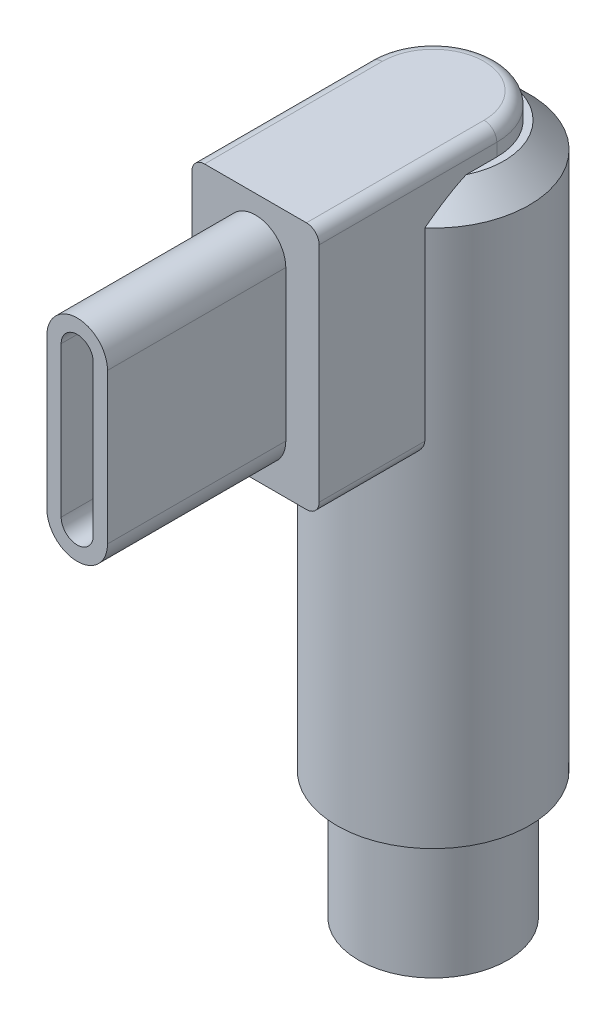
ISO-10303-21;
HEADER;
FILE_DESCRIPTION(('STEP AP214'),'2;1');
FILE_NAME('part.step','',(''),(''),'','','');
FILE_SCHEMA(('AUTOMOTIVE_DESIGN { 1 0 10303 214 1 1 1 1 }'));
ENDSEC;
DATA;
#1=APPLICATION_CONTEXT('core data for automotive mechanical design processes');
#2=APPLICATION_PROTOCOL_DEFINITION('international standard','automotive_design',2000,#1);
#3=PRODUCT_CONTEXT('',#1,'mechanical');
#4=PRODUCT('Part','Part','',(#3));
#5=PRODUCT_RELATED_PRODUCT_CATEGORY('part','',(#4));
#6=PRODUCT_DEFINITION_FORMATION('','',#4);
#7=PRODUCT_DEFINITION_CONTEXT('part definition',#1,'design');
#8=PRODUCT_DEFINITION('design','',#6,#7);
#9=PRODUCT_DEFINITION_SHAPE('','',#8);
#10=(LENGTH_UNIT() NAMED_UNIT(*) SI_UNIT(.MILLI.,.METRE.));
#11=(NAMED_UNIT(*) PLANE_ANGLE_UNIT() SI_UNIT($,.RADIAN.));
#12=(NAMED_UNIT(*) SI_UNIT($,.STERADIAN.) SOLID_ANGLE_UNIT());
#13=UNCERTAINTY_MEASURE_WITH_UNIT(LENGTH_MEASURE(1.E-05),#10,'distance_accuracy_value','');
#14=(GEOMETRIC_REPRESENTATION_CONTEXT(3) GLOBAL_UNCERTAINTY_ASSIGNED_CONTEXT((#13)) GLOBAL_UNIT_ASSIGNED_CONTEXT((#10,
#11,#12)) REPRESENTATION_CONTEXT('',''));
#15=CARTESIAN_POINT('',(0.,0.,0.));
#16=DIRECTION('',(0.,0.,1.));
#17=DIRECTION('',(1.,0.,0.));
#18=AXIS2_PLACEMENT_3D('',#15,#16,#17);
#19=CARTESIAN_POINT('',(0.,28.1,0.));
#20=DIRECTION('',(0.,-1.,0.));
#21=DIRECTION('',(0.,0.,-1.));
#22=AXIS2_PLACEMENT_3D('',#19,#20,#21);
#23=CYLINDRICAL_SURFACE('',#22,3.775);
#24=CARTESIAN_POINT('',(0.,5.,0.));
#25=DIRECTION('',(0.,1.,0.));
#26=DIRECTION('',(0.,0.,1.));
#27=AXIS2_PLACEMENT_3D('',#24,#25,#26);
#28=CIRCLE('',#27,3.775);
#29=CARTESIAN_POINT('',(0.,5.,3.775));
#30=VERTEX_POINT('',#29);
#31=EDGE_CURVE('E289',#30,#30,#28,.T.);
#32=ORIENTED_EDGE('',*,*,#31,.T.);
#33=EDGE_LOOP('',(#32));
#34=FACE_BOUND('',#33,.T.);
#35=DIRECTION('',(0.,-1.,0.));
#36=VECTOR('',#35,1.);
#37=CARTESIAN_POINT('',(-2.5,28.1,2.82853760802292));
#38=LINE('',#37,#36);
#39=CARTESIAN_POINT('',(-2.5,26.1,2.82853760802292));
#40=VERTEX_POINT('',#39);
#41=CARTESIAN_POINT('',(-2.5,18.85,2.82853760802292));
#42=VERTEX_POINT('',#41);
#43=EDGE_CURVE('E269',#40,#42,#38,.T.);
#44=ORIENTED_EDGE('',*,*,#43,.F.);
#45=CARTESIAN_POINT('',(0.,26.1,0.));
#46=DIRECTION('',(0.,1.,0.));
#47=DIRECTION('',(0.,0.,1.));
#48=AXIS2_PLACEMENT_3D('',#45,#46,#47);
#49=CIRCLE('',#48,3.775);
#50=CARTESIAN_POINT('',(2.5,26.1,2.82853760802292));
#51=VERTEX_POINT('',#50);
#52=EDGE_CURVE('E300',#40,#51,#49,.F.);
#53=ORIENTED_EDGE('',*,*,#52,.T.);
#54=DIRECTION('',(0.,-1.,0.));
#55=VECTOR('',#54,1.);
#56=CARTESIAN_POINT('',(2.5,28.1,2.82853760802292));
#57=LINE('',#56,#55);
#58=CARTESIAN_POINT('',(2.5,18.85,2.82853760802292));
#59=VERTEX_POINT('',#58);
#60=EDGE_CURVE('E272',#59,#51,#57,.F.);
#61=ORIENTED_EDGE('',*,*,#60,.F.);
#62=CARTESIAN_POINT('',(2.5,18.85,2.82853760802292));
#63=CARTESIAN_POINT('',(2.5000369379469,18.826457102281,2.82849614022547));
#64=CARTESIAN_POINT('',(2.49833999016514,18.8029734489008,2.8300050813574));
#65=CARTESIAN_POINT('',(2.49180621462881,18.7569883192918,2.8357641199373));
#66=CARTESIAN_POINT('',(2.48699602477203,18.734480223276,2.83999096019166));
#67=CARTESIAN_POINT('',(2.47457109758775,18.6909498361622,2.85082196215042));
#68=CARTESIAN_POINT('',(2.46696411444391,18.6699236267678,2.85741954976028));
#69=CARTESIAN_POINT('',(2.44934553663139,18.6296058667352,2.87253677117939));
#70=CARTESIAN_POINT('',(2.43932823042136,18.6103185882128,2.88106096735652));
#71=CARTESIAN_POINT('',(2.41313053460092,18.5668250708692,2.90307005166998));
#72=CARTESIAN_POINT('',(2.39604895389874,18.5434955124402,2.91721512620181));
#73=CARTESIAN_POINT('',(2.35890477449549,18.5007264201281,2.94733217504659));
#74=CARTESIAN_POINT('',(2.33883833515682,18.4812919748771,2.96330649687753));
#75=CARTESIAN_POINT('',(2.2959948591727,18.4460586800113,2.99662818692633));
#76=CARTESIAN_POINT('',(2.27317815287008,18.4303259628401,3.0139940295335));
#77=CARTESIAN_POINT('',(2.22562996398549,18.4029615910862,3.04927452193336));
#78=CARTESIAN_POINT('',(2.2008993059963,18.3913281822522,3.06718893339641));
#79=CARTESIAN_POINT('',(2.14758041771138,18.3713521145292,3.10478245415861));
#80=CARTESIAN_POINT('',(2.11884692516726,18.3634130958183,3.12447160106304));
#81=CARTESIAN_POINT('',(2.06017590948722,18.3527419858257,3.16347465852328));
#82=CARTESIAN_POINT('',(2.03023807377893,18.3500112553102,3.18278846971109));
#83=CARTESIAN_POINT('',(2.,18.35,3.20165972582971));
#84=B_SPLINE_CURVE_WITH_KNOTS('',3,(#62,#63,#64,#65,#66,#67,#68,#69,#70,#71,#72,#73,#74,#75,#76,
#77,#78,#79,#80,#81,#82,#83),.UNSPECIFIED.,.F.,.F.,(4,2,2,2,2,2,2,2,2,2,4),(0.,
0.0704255173164462,0.140256278059766,0.209894873453453,0.279700139499729,0.375748188194619,
0.471920909067463,0.569699667782268,0.667436532255682,0.774208802935048,0.881008966119465),.UNSPECIFIED.);
#85=CARTESIAN_POINT('',(2.,18.35,3.20165972582971));
#86=VERTEX_POINT('',#85);
#87=EDGE_CURVE('E13',#59,#86,#84,.T.);
#88=ORIENTED_EDGE('',*,*,#87,.T.);
#89=CARTESIAN_POINT('',(0.,18.35,0.));
#90=DIRECTION('',(0.,-1.,0.));
#91=DIRECTION('',(0.,0.,-1.));
#92=AXIS2_PLACEMENT_3D('',#89,#90,#91);
#93=CIRCLE('',#92,3.775);
#94=CARTESIAN_POINT('',(-2.,18.35,3.20165972582971));
#95=VERTEX_POINT('',#94);
#96=EDGE_CURVE('E273',#95,#86,#93,.F.);
#97=ORIENTED_EDGE('',*,*,#96,.F.);
#98=CARTESIAN_POINT('',(-2.,18.35,3.20165972582971));
#99=CARTESIAN_POINT('',(-2.03606850331327,18.3500248556165,3.17916413676862));
#100=CARTESIAN_POINT('',(-2.07169973642586,18.3539008427553,3.15602520589106));
#101=CARTESIAN_POINT('',(-2.14125396079077,18.3690368250493,3.10923780757989));
#102=CARTESIAN_POINT('',(-2.17516849392718,18.3803301489529,3.08558750846223));
#103=CARTESIAN_POINT('',(-2.23803482981118,18.4090282202888,3.04027084309099));
#104=CARTESIAN_POINT('',(-2.26716529912488,18.4259959942354,3.01857431952126));
#105=CARTESIAN_POINT('',(-2.32202388109657,18.4660088804958,2.97657728094078));
#106=CARTESIAN_POINT('',(-2.3477595846894,18.4890400765204,2.95627370177127));
#107=CARTESIAN_POINT('',(-2.38792576050043,18.533560461974,2.92385018278229));
#108=CARTESIAN_POINT('',(-2.40347132912667,18.5535630200646,2.91106357384926));
#109=CARTESIAN_POINT('',(-2.43175099167725,18.5965245498283,2.88748151207099));
#110=CARTESIAN_POINT('',(-2.44448880345045,18.6194795474763,2.87668342930648));
#111=CARTESIAN_POINT('',(-2.46450272287878,18.6636785490475,2.85954428843174));
#112=CARTESIAN_POINT('',(-2.4723490863816,18.6844878771238,2.85275091864194));
#113=CARTESIAN_POINT('',(-2.48528644191277,18.7275291285085,2.84148739434813));
#114=CARTESIAN_POINT('',(-2.49038316632742,18.7497579832965,2.83701240731115));
#115=CARTESIAN_POINT('',(-2.49594463538548,18.7851457922843,2.83211799873875));
#116=CARTESIAN_POINT('',(-2.49746022269047,18.7980242100382,2.83078089201309));
#117=CARTESIAN_POINT('',(-2.49948971376825,18.8239320499596,2.82898865745538));
#118=CARTESIAN_POINT('',(-2.5000026982415,18.8369615997031,2.82853433906561));
#119=CARTESIAN_POINT('',(-2.5,18.85,2.82853760802291));
#120=B_SPLINE_CURVE_WITH_KNOTS('',3,(#98,#99,#100,#101,#102,#103,#104,#105,#106,#107,#108,#109,
#110,#111,#112,#113,#114,#115,#116,#117,#118,#119),.UNSPECIFIED.,.F.,.F.,(4,2,2,2,2,2,2,2,2,2,
4),(0.,0.127315986871851,0.255208000196736,0.374921949854657,0.494363501149973,
0.579198459174759,0.663920400317473,0.733406456844945,0.802747085029367,0.841792147011757,
0.880872993153382),.UNSPECIFIED.);
#121=EDGE_CURVE('E60',#95,#42,#120,.T.);
#122=ORIENTED_EDGE('',*,*,#121,.T.);
#123=EDGE_LOOP('',(#44,#53,#61,#88,#97,#122));
#124=FACE_BOUND('',#123,.T.);
#125=ADVANCED_FACE('F50',(#34,#124),#23,.T.);
#126=CARTESIAN_POINT('',(0.,0.,6.975));
#127=DIRECTION('',(0.,0.,1.));
#128=DIRECTION('',(1.,0.,0.));
#129=AXIS2_PLACEMENT_3D('',#126,#127,#128);
#130=PLANE('',#129);
#131=DIRECTION('',(0.,-1.,0.));
#132=VECTOR('',#131,1.);
#133=CARTESIAN_POINT('',(-2.5,28.1,6.975));
#134=LINE('',#133,#132);
#135=CARTESIAN_POINT('',(-2.5,27.6,6.975));
#136=VERTEX_POINT('',#135);
#137=CARTESIAN_POINT('',(-2.5,18.85,6.975));
#138=VERTEX_POINT('',#137);
#139=EDGE_CURVE('E276',#136,#138,#134,.T.);
#140=ORIENTED_EDGE('',*,*,#139,.T.);
#141=CARTESIAN_POINT('',(-2.,18.85,6.975));
#142=DIRECTION('',(0.,0.,1.));
#143=DIRECTION('',(1.,0.,0.));
#144=AXIS2_PLACEMENT_3D('',#141,#142,#143);
#145=CIRCLE('',#144,0.5);
#146=CARTESIAN_POINT('',(-2.,18.35,6.975));
#147=VERTEX_POINT('',#146);
#148=EDGE_CURVE('E409',#138,#147,#145,.T.);
#149=ORIENTED_EDGE('',*,*,#148,.T.);
#150=DIRECTION('',(1.,0.,0.));
#151=VECTOR('',#150,1.);
#152=CARTESIAN_POINT('',(-2.5,18.35,6.975));
#153=LINE('',#152,#151);
#154=CARTESIAN_POINT('',(2.,18.35,6.975));
#155=VERTEX_POINT('',#154);
#156=EDGE_CURVE('E280',#147,#155,#153,.T.);
#157=ORIENTED_EDGE('',*,*,#156,.T.);
#158=CARTESIAN_POINT('',(2.,18.85,6.975));
#159=DIRECTION('',(0.,0.,1.));
#160=DIRECTION('',(1.,0.,0.));
#161=AXIS2_PLACEMENT_3D('',#158,#159,#160);
#162=CIRCLE('',#161,0.5);
#163=CARTESIAN_POINT('',(2.5,18.85,6.975));
#164=VERTEX_POINT('',#163);
#165=EDGE_CURVE('E405',#155,#164,#162,.T.);
#166=ORIENTED_EDGE('',*,*,#165,.T.);
#167=DIRECTION('',(0.,1.,0.));
#168=VECTOR('',#167,1.);
#169=CARTESIAN_POINT('',(2.5,28.1,6.975));
#170=LINE('',#169,#168);
#171=CARTESIAN_POINT('',(2.5,27.6,6.975));
#172=VERTEX_POINT('',#171);
#173=EDGE_CURVE('E283',#164,#172,#170,.T.);
#174=ORIENTED_EDGE('',*,*,#173,.T.);
#175=CARTESIAN_POINT('',(2.,27.6,6.975));
#176=DIRECTION('',(0.,0.,1.));
#177=DIRECTION('',(1.,0.,0.));
#178=AXIS2_PLACEMENT_3D('',#175,#176,#177);
#179=CIRCLE('',#178,0.5);
#180=CARTESIAN_POINT('',(2.,28.1,6.975));
#181=VERTEX_POINT('',#180);
#182=EDGE_CURVE('E403',#172,#181,#179,.T.);
#183=ORIENTED_EDGE('',*,*,#182,.T.);
#184=DIRECTION('',(-1.,0.,0.));
#185=VECTOR('',#184,1.);
#186=CARTESIAN_POINT('',(-2.5,28.1,6.975));
#187=LINE('',#186,#185);
#188=CARTESIAN_POINT('',(-2.,28.1,6.975));
#189=VERTEX_POINT('',#188);
#190=EDGE_CURVE('E286',#181,#189,#187,.T.);
#191=ORIENTED_EDGE('',*,*,#190,.T.);
#192=CARTESIAN_POINT('',(-2.,27.6,6.975));
#193=DIRECTION('',(0.,0.,1.));
#194=DIRECTION('',(1.,0.,0.));
#195=AXIS2_PLACEMENT_3D('',#192,#193,#194);
#196=CIRCLE('',#195,0.5);
#197=EDGE_CURVE('E407',#189,#136,#196,.T.);
#198=ORIENTED_EDGE('',*,*,#197,.T.);
#199=EDGE_LOOP('',(#140,#149,#157,#166,#174,#183,#191,#198));
#200=FACE_BOUND('',#199,.T.);
#201=DIRECTION('',(0.,-1.,0.));
#202=VECTOR('',#201,1.);
#203=CARTESIAN_POINT('',(-1.19,26.175,6.975));
#204=LINE('',#203,#202);
#205=CARTESIAN_POINT('',(-1.19,26.175,6.975));
#206=VERTEX_POINT('',#205);
#207=CARTESIAN_POINT('',(-1.19,20.275,6.975));
#208=VERTEX_POINT('',#207);
#209=EDGE_CURVE('E254',#206,#208,#204,.T.);
#210=ORIENTED_EDGE('',*,*,#209,.F.);
#211=CARTESIAN_POINT('',(0.,26.175,6.975));
#212=DIRECTION('',(0.,0.,1.));
#213=DIRECTION('',(1.,0.,0.));
#214=AXIS2_PLACEMENT_3D('',#211,#212,#213);
#215=CIRCLE('',#214,1.19);
#216=CARTESIAN_POINT('',(1.19,26.175,6.975));
#217=VERTEX_POINT('',#216);
#218=EDGE_CURVE('E240',#217,#206,#215,.T.);
#219=ORIENTED_EDGE('',*,*,#218,.F.);
#220=DIRECTION('',(0.,1.,0.));
#221=VECTOR('',#220,1.);
#222=CARTESIAN_POINT('',(1.19,26.175,6.975));
#223=LINE('',#222,#221);
#224=CARTESIAN_POINT('',(1.19,20.275,6.975));
#225=VERTEX_POINT('',#224);
#226=EDGE_CURVE('E245',#225,#217,#223,.T.);
#227=ORIENTED_EDGE('',*,*,#226,.F.);
#228=CARTESIAN_POINT('',(0.,20.275,6.975));
#229=DIRECTION('',(0.,0.,1.));
#230=DIRECTION('',(1.,0.,0.));
#231=AXIS2_PLACEMENT_3D('',#228,#229,#230);
#232=CIRCLE('',#231,1.19);
#233=EDGE_CURVE('E256',#208,#225,#232,.T.);
#234=ORIENTED_EDGE('',*,*,#233,.F.);
#235=EDGE_LOOP('',(#210,#219,#227,#234));
#236=FACE_BOUND('',#235,.T.);
#237=ADVANCED_FACE('F357',(#200,#236),#130,.T.);
#238=CARTESIAN_POINT('',(0.,5.,0.));
#239=DIRECTION('',(0.,-1.,0.));
#240=DIRECTION('',(0.,0.,-1.));
#241=AXIS2_PLACEMENT_3D('',#238,#239,#240);
#242=CYLINDRICAL_SURFACE('',#241,2.925);
#243=CARTESIAN_POINT('',(0.,5.,0.));
#244=DIRECTION('',(0.,1.,0.));
#245=DIRECTION('',(0.,0.,1.));
#246=AXIS2_PLACEMENT_3D('',#243,#244,#245);
#247=CIRCLE('',#246,2.925);
#248=CARTESIAN_POINT('',(0.,5.,2.925));
#249=VERTEX_POINT('',#248);
#250=EDGE_CURVE('E293',#249,#249,#247,.T.);
#251=ORIENTED_EDGE('',*,*,#250,.F.);
#252=EDGE_LOOP('',(#251));
#253=FACE_BOUND('',#252,.T.);
#254=CARTESIAN_POINT('',(0.,0.,0.));
#255=DIRECTION('',(0.,1.,0.));
#256=DIRECTION('',(0.,0.,1.));
#257=AXIS2_PLACEMENT_3D('',#254,#255,#256);
#258=CIRCLE('',#257,2.925);
#259=CARTESIAN_POINT('',(0.,0.,2.925));
#260=VERTEX_POINT('',#259);
#261=EDGE_CURVE('E292',#260,#260,#258,.T.);
#262=ORIENTED_EDGE('',*,*,#261,.T.);
#263=EDGE_LOOP('',(#262));
#264=FACE_BOUND('',#263,.T.);
#265=ADVANCED_FACE('F331',(#253,#264),#242,.T.);
#266=CARTESIAN_POINT('',(0.,0.,0.));
#267=DIRECTION('',(0.,1.,0.));
#268=DIRECTION('',(0.,0.,1.));
#269=AXIS2_PLACEMENT_3D('',#266,#267,#268);
#270=PLANE('',#269);
#271=ORIENTED_EDGE('',*,*,#261,.F.);
#272=EDGE_LOOP('',(#271));
#273=FACE_BOUND('',#272,.T.);
#274=ADVANCED_FACE('F360',(#273),#270,.F.);
#275=CARTESIAN_POINT('',(0.,28.1,0.));
#276=DIRECTION('',(0.,1.,0.));
#277=DIRECTION('',(0.,0.,1.));
#278=AXIS2_PLACEMENT_3D('',#275,#276,#277);
#279=PLANE('',#278);
#280=CARTESIAN_POINT('',(0.,28.1,0.));
#281=DIRECTION('',(0.,1.,0.));
#282=DIRECTION('',(0.,0.,1.));
#283=AXIS2_PLACEMENT_3D('',#280,#281,#282);
#284=CIRCLE('',#283,2.);
#285=CARTESIAN_POINT('',(2.,28.1,0.));
#286=VERTEX_POINT('',#285);
#287=CARTESIAN_POINT('',(-2.,28.1,0.));
#288=VERTEX_POINT('',#287);
#289=EDGE_CURVE('E413',#286,#288,#284,.T.);
#290=ORIENTED_EDGE('',*,*,#289,.T.);
#291=DIRECTION('',(0.,0.,-1.));
#292=VECTOR('',#291,1.);
#293=CARTESIAN_POINT('',(-2.,28.1,6.975));
#294=LINE('',#293,#292);
#295=EDGE_CURVE('E415',#288,#189,#294,.F.);
#296=ORIENTED_EDGE('',*,*,#295,.T.);
#297=ORIENTED_EDGE('',*,*,#190,.F.);
#298=DIRECTION('',(0.,0.,-1.));
#299=VECTOR('',#298,1.);
#300=CARTESIAN_POINT('',(2.,28.1,0.));
#301=LINE('',#300,#299);
#302=EDGE_CURVE('E411',#181,#286,#301,.T.);
#303=ORIENTED_EDGE('',*,*,#302,.T.);
#304=EDGE_LOOP('',(#290,#296,#297,#303));
#305=FACE_BOUND('',#304,.T.);
#306=ADVANCED_FACE('F363',(#305),#279,.T.);
#307=CARTESIAN_POINT('',(0.,5.,0.));
#308=DIRECTION('',(0.,1.,0.));
#309=DIRECTION('',(0.,0.,1.));
#310=AXIS2_PLACEMENT_3D('',#307,#308,#309);
#311=PLANE('',#310);
#312=ORIENTED_EDGE('',*,*,#250,.T.);
#313=EDGE_LOOP('',(#312));
#314=FACE_BOUND('',#313,.T.);
#315=ORIENTED_EDGE('',*,*,#31,.F.);
#316=EDGE_LOOP('',(#315));
#317=FACE_BOUND('',#316,.T.);
#318=ADVANCED_FACE('F359',(#314,#317),#311,.F.);
#319=CARTESIAN_POINT('',(-2.5,28.1,6.975));
#320=DIRECTION('',(1.,0.,0.));
#321=DIRECTION('',(0.,1.,0.));
#322=AXIS2_PLACEMENT_3D('',#319,#320,#321);
#323=PLANE('',#322);
#324=ORIENTED_EDGE('',*,*,#43,.T.);
#325=DIRECTION('',(0.,0.,-1.));
#326=VECTOR('',#325,1.);
#327=CARTESIAN_POINT('',(-2.5,18.85,6.975));
#328=LINE('',#327,#326);
#329=EDGE_CURVE('E401',#42,#138,#328,.F.);
#330=ORIENTED_EDGE('',*,*,#329,.T.);
#331=ORIENTED_EDGE('',*,*,#139,.F.);
#332=DIRECTION('',(0.,0.,-1.));
#333=VECTOR('',#332,1.);
#334=CARTESIAN_POINT('',(-2.5,27.6,0.));
#335=LINE('',#334,#333);
#336=CARTESIAN_POINT('',(-2.5,27.6,0.));
#337=VERTEX_POINT('',#336);
#338=EDGE_CURVE('E396',#136,#337,#335,.T.);
#339=ORIENTED_EDGE('',*,*,#338,.T.);
#340=DIRECTION('',(0.,1.,0.));
#341=VECTOR('',#340,1.);
#342=CARTESIAN_POINT('',(-2.5,27.1,0.));
#343=LINE('',#342,#341);
#344=CARTESIAN_POINT('',(-2.5,27.1,0.));
#345=VERTEX_POINT('',#344);
#346=EDGE_CURVE('E189',#345,#337,#343,.T.);
#347=ORIENTED_EDGE('',*,*,#346,.F.);
#348=DIRECTION('',(0.,0.,-1.));
#349=VECTOR('',#348,1.);
#350=CARTESIAN_POINT('',(-2.5,27.1,0.));
#351=LINE('',#350,#349);
#352=CARTESIAN_POINT('',(-2.5,27.1,1.20441894704457));
#353=VERTEX_POINT('',#352);
#354=EDGE_CURVE('E190',#353,#345,#351,.T.);
#355=ORIENTED_EDGE('',*,*,#354,.F.);
#356=CARTESIAN_POINT('',(-2.5,27.1,1.20441894704457));
#357=CARTESIAN_POINT('',(-2.5,27.06817489987,1.27769798374855));
#358=CARTESIAN_POINT('',(-2.5,27.0344138305237,1.3501012406047));
#359=CARTESIAN_POINT('',(-2.5,26.9636575458132,1.49325643323808));
#360=CARTESIAN_POINT('',(-2.5,26.9266644504029,1.56400941344375));
#361=CARTESIAN_POINT('',(-2.5,26.8501576305321,1.70384225563926));
#362=CARTESIAN_POINT('',(-2.5,26.8106520753071,1.77292662426145));
#363=CARTESIAN_POINT('',(-2.5,26.729468136726,1.90981786602526));
#364=CARTESIAN_POINT('',(-2.5,26.6877893640542,1.97762450728912));
#365=CARTESIAN_POINT('',(-2.5,26.5602247200458,2.1791237837645));
#366=CARTESIAN_POINT('',(-2.5,26.4716772433656,2.31113321834032));
#367=CARTESIAN_POINT('',(-2.5,26.3350114179661,2.50672696361921));
#368=CARTESIAN_POINT('',(-2.5,26.2887375177751,2.57162431907002));
#369=CARTESIAN_POINT('',(-2.5,26.1951252312258,2.70063805607783));
#370=CARTESIAN_POINT('',(-2.5,26.1477869455196,2.76475451060295));
#371=CARTESIAN_POINT('',(-2.5,26.1,2.82853760802291));
#372=B_SPLINE_CURVE_WITH_KNOTS('',3,(#356,#357,#358,#359,#360,#361,#362,#363,#364,#365,#366,
#367,#368,#369,#370,#371),.UNSPECIFIED.,.F.,.F.,(4,2,2,2,2,2,2,4),(0.,0.239599889392296,
0.479043783407813,0.717745420353795,0.956489966819155,1.43316333775114,1.67227360257733,
1.9113613505981),.UNSPECIFIED.);
#373=EDGE_CURVE('E303',#353,#40,#372,.T.);
#374=ORIENTED_EDGE('',*,*,#373,.T.);
#375=EDGE_LOOP('',(#324,#330,#331,#339,#347,#355,#374));
#376=FACE_BOUND('',#375,.T.);
#377=ADVANCED_FACE('F317',(#376),#323,.F.);
#378=CARTESIAN_POINT('',(-2.5,18.35,6.975));
#379=DIRECTION('',(0.,1.,0.));
#380=DIRECTION('',(0.,0.,1.));
#381=AXIS2_PLACEMENT_3D('',#378,#379,#380);
#382=PLANE('',#381);
#383=ORIENTED_EDGE('',*,*,#156,.F.);
#384=DIRECTION('',(0.,0.,-1.));
#385=VECTOR('',#384,1.);
#386=CARTESIAN_POINT('',(-2.,18.35,6.975));
#387=LINE('',#386,#385);
#388=EDGE_CURVE('E392',#147,#95,#387,.T.);
#389=ORIENTED_EDGE('',*,*,#388,.T.);
#390=ORIENTED_EDGE('',*,*,#96,.T.);
#391=DIRECTION('',(0.,0.,-1.));
#392=VECTOR('',#391,1.);
#393=CARTESIAN_POINT('',(2.,18.35,6.975));
#394=LINE('',#393,#392);
#395=EDGE_CURVE('E391',#86,#155,#394,.F.);
#396=ORIENTED_EDGE('',*,*,#395,.T.);
#397=EDGE_LOOP('',(#383,#389,#390,#396));
#398=FACE_BOUND('',#397,.T.);
#399=ADVANCED_FACE('F419',(#398),#382,.F.);
#400=CARTESIAN_POINT('',(2.5,28.1,6.975));
#401=DIRECTION('',(-1.,0.,0.));
#402=DIRECTION('',(0.,-1.,0.));
#403=AXIS2_PLACEMENT_3D('',#400,#401,#402);
#404=PLANE('',#403);
#405=ORIENTED_EDGE('',*,*,#173,.F.);
#406=DIRECTION('',(0.,0.,-1.));
#407=VECTOR('',#406,1.);
#408=CARTESIAN_POINT('',(2.5,18.85,6.975));
#409=LINE('',#408,#407);
#410=EDGE_CURVE('E348',#164,#59,#409,.T.);
#411=ORIENTED_EDGE('',*,*,#410,.T.);
#412=ORIENTED_EDGE('',*,*,#60,.T.);
#413=CARTESIAN_POINT('',(2.5,26.1,2.82853760802292));
#414=CARTESIAN_POINT('',(2.5,26.1477869455196,2.76475451060296));
#415=CARTESIAN_POINT('',(2.5,26.1951252312258,2.70063805607783));
#416=CARTESIAN_POINT('',(2.5,26.2887375177751,2.57162431907002));
#417=CARTESIAN_POINT('',(2.5,26.3350114179661,2.50672696361921));
#418=CARTESIAN_POINT('',(2.5,26.4716772433656,2.31113321834032));
#419=CARTESIAN_POINT('',(2.5,26.5602247200458,2.1791237837645));
#420=CARTESIAN_POINT('',(2.5,26.6877893640542,1.97762450728912));
#421=CARTESIAN_POINT('',(2.5,26.729468136726,1.90981786602526));
#422=CARTESIAN_POINT('',(2.5,26.8106520753071,1.77292662426145));
#423=CARTESIAN_POINT('',(2.5,26.8501576305321,1.70384225563926));
#424=CARTESIAN_POINT('',(2.5,26.9266644504029,1.56400941344376));
#425=CARTESIAN_POINT('',(2.5,26.9636575458132,1.49325643323808));
#426=CARTESIAN_POINT('',(2.5,27.0344138305237,1.3501012406047));
#427=CARTESIAN_POINT('',(2.5,27.06817489987,1.27769798374855));
#428=CARTESIAN_POINT('',(2.5,27.1,1.20441894704458));
#429=B_SPLINE_CURVE_WITH_KNOTS('',3,(#413,#414,#415,#416,#417,#418,#419,#420,#421,#422,#423,
#424,#425,#426,#427,#428),.UNSPECIFIED.,.F.,.F.,(4,2,2,2,2,2,2,4),(0.,0.239087748020767,
0.478198012846965,0.954871383778947,1.19361593024431,1.43231756719029,1.6717614612058,
1.9113613505981),.UNSPECIFIED.);
#430=CARTESIAN_POINT('',(2.5,27.1,1.20441894704457));
#431=VERTEX_POINT('',#430);
#432=EDGE_CURVE('E197',#51,#431,#429,.T.);
#433=ORIENTED_EDGE('',*,*,#432,.T.);
#434=DIRECTION('',(0.,0.,1.));
#435=VECTOR('',#434,1.);
#436=CARTESIAN_POINT('',(2.5,27.1,0.));
#437=LINE('',#436,#435);
#438=CARTESIAN_POINT('',(2.5,27.1,0.));
#439=VERTEX_POINT('',#438);
#440=EDGE_CURVE('E193',#439,#431,#437,.T.);
#441=ORIENTED_EDGE('',*,*,#440,.F.);
#442=DIRECTION('',(0.,1.,0.));
#443=VECTOR('',#442,1.);
#444=CARTESIAN_POINT('',(2.5,27.1,0.));
#445=LINE('',#444,#443);
#446=CARTESIAN_POINT('',(2.5,27.6,0.));
#447=VERTEX_POINT('',#446);
#448=EDGE_CURVE('E182',#439,#447,#445,.T.);
#449=ORIENTED_EDGE('',*,*,#448,.T.);
#450=DIRECTION('',(0.,0.,-1.));
#451=VECTOR('',#450,1.);
#452=CARTESIAN_POINT('',(2.5,27.6,6.975));
#453=LINE('',#452,#451);
#454=EDGE_CURVE('E417',#447,#172,#453,.F.);
#455=ORIENTED_EDGE('',*,*,#454,.T.);
#456=EDGE_LOOP('',(#405,#411,#412,#433,#441,#449,#455));
#457=FACE_BOUND('',#456,.T.);
#458=ADVANCED_FACE('F195',(#457),#404,.F.);
#459=CARTESIAN_POINT('',(0.,26.175,13.975));
#460=DIRECTION('',(0.,0.,1.));
#461=DIRECTION('',(1.,0.,0.));
#462=AXIS2_PLACEMENT_3D('',#459,#460,#461);
#463=PLANE('',#462);
#464=CARTESIAN_POINT('',(0.,26.175,13.975));
#465=DIRECTION('',(0.,0.,1.));
#466=DIRECTION('',(1.,0.,0.));
#467=AXIS2_PLACEMENT_3D('',#464,#465,#466);
#468=CIRCLE('',#467,1.19);
#469=CARTESIAN_POINT('',(1.19,26.175,13.975));
#470=VERTEX_POINT('',#469);
#471=CARTESIAN_POINT('',(-1.19,26.175,13.975));
#472=VERTEX_POINT('',#471);
#473=EDGE_CURVE('E241',#470,#472,#468,.T.);
#474=ORIENTED_EDGE('',*,*,#473,.T.);
#475=DIRECTION('',(0.,-1.,0.));
#476=VECTOR('',#475,1.);
#477=CARTESIAN_POINT('',(-1.19,26.175,13.975));
#478=LINE('',#477,#476);
#479=CARTESIAN_POINT('',(-1.19,20.275,13.975));
#480=VERTEX_POINT('',#479);
#481=EDGE_CURVE('E244',#472,#480,#478,.T.);
#482=ORIENTED_EDGE('',*,*,#481,.T.);
#483=CARTESIAN_POINT('',(0.,20.275,13.975));
#484=DIRECTION('',(0.,0.,1.));
#485=DIRECTION('',(1.,0.,0.));
#486=AXIS2_PLACEMENT_3D('',#483,#484,#485);
#487=CIRCLE('',#486,1.19);
#488=CARTESIAN_POINT('',(1.19,20.275,13.975));
#489=VERTEX_POINT('',#488);
#490=EDGE_CURVE('E247',#480,#489,#487,.T.);
#491=ORIENTED_EDGE('',*,*,#490,.T.);
#492=DIRECTION('',(0.,1.,0.));
#493=VECTOR('',#492,1.);
#494=CARTESIAN_POINT('',(1.19,26.175,13.975));
#495=LINE('',#494,#493);
#496=EDGE_CURVE('E249',#489,#470,#495,.T.);
#497=ORIENTED_EDGE('',*,*,#496,.T.);
#498=EDGE_LOOP('',(#474,#482,#491,#497));
#499=FACE_BOUND('',#498,.T.);
#500=DIRECTION('',(0.,-1.,0.));
#501=VECTOR('',#500,1.);
#502=CARTESIAN_POINT('',(-0.630000000000001,26.175,13.975));
#503=LINE('',#502,#501);
#504=CARTESIAN_POINT('',(-0.630000000000001,26.175,13.975));
#505=VERTEX_POINT('',#504);
#506=CARTESIAN_POINT('',(-0.630000000000004,20.275,13.975));
#507=VERTEX_POINT('',#506);
#508=EDGE_CURVE('E214',#505,#507,#503,.T.);
#509=ORIENTED_EDGE('',*,*,#508,.F.);
#510=CARTESIAN_POINT('',(0.,26.175,13.975));
#511=DIRECTION('',(0.,0.,1.));
#512=DIRECTION('',(1.,0.,0.));
#513=AXIS2_PLACEMENT_3D('',#510,#511,#512);
#514=CIRCLE('',#513,0.630000000000002);
#515=CARTESIAN_POINT('',(0.630000000000003,26.175,13.975));
#516=VERTEX_POINT('',#515);
#517=EDGE_CURVE('E212',#516,#505,#514,.T.);
#518=ORIENTED_EDGE('',*,*,#517,.F.);
#519=DIRECTION('',(0.,1.,0.));
#520=VECTOR('',#519,1.);
#521=CARTESIAN_POINT('',(0.630000000000003,26.175,13.975));
#522=LINE('',#521,#520);
#523=CARTESIAN_POINT('',(0.630000000000003,20.275,13.975));
#524=VERTEX_POINT('',#523);
#525=EDGE_CURVE('E220',#524,#516,#522,.T.);
#526=ORIENTED_EDGE('',*,*,#525,.F.);
#527=CARTESIAN_POINT('',(0.,20.275,13.975));
#528=DIRECTION('',(0.,0.,1.));
#529=DIRECTION('',(1.,0.,0.));
#530=AXIS2_PLACEMENT_3D('',#527,#528,#529);
#531=CIRCLE('',#530,0.630000000000002);
#532=EDGE_CURVE('E217',#507,#524,#531,.T.);
#533=ORIENTED_EDGE('',*,*,#532,.F.);
#534=EDGE_LOOP('',(#509,#518,#526,#533));
#535=FACE_BOUND('',#534,.T.);
#536=ADVANCED_FACE('F478',(#499,#535),#463,.T.);
#537=CARTESIAN_POINT('',(0.,26.175,13.975));
#538=DIRECTION('',(0.,0.,-1.));
#539=DIRECTION('',(-1.,0.,0.));
#540=AXIS2_PLACEMENT_3D('',#537,#538,#539);
#541=CYLINDRICAL_SURFACE('',#540,1.19);
#542=ORIENTED_EDGE('',*,*,#218,.T.);
#543=DIRECTION('',(0.,0.,-1.));
#544=VECTOR('',#543,1.);
#545=CARTESIAN_POINT('',(-1.19,26.175,13.975));
#546=LINE('',#545,#544);
#547=EDGE_CURVE('E267',#472,#206,#546,.T.);
#548=ORIENTED_EDGE('',*,*,#547,.F.);
#549=ORIENTED_EDGE('',*,*,#473,.F.);
#550=DIRECTION('',(0.,0.,-1.));
#551=VECTOR('',#550,1.);
#552=CARTESIAN_POINT('',(1.19,26.175,13.975));
#553=LINE('',#552,#551);
#554=EDGE_CURVE('E251',#470,#217,#553,.T.);
#555=ORIENTED_EDGE('',*,*,#554,.T.);
#556=EDGE_LOOP('',(#542,#548,#549,#555));
#557=FACE_BOUND('',#556,.T.);
#558=ADVANCED_FACE('F584',(#557),#541,.T.);
#559=CARTESIAN_POINT('',(-1.19,26.175,13.975));
#560=DIRECTION('',(1.,0.,0.));
#561=DIRECTION('',(0.,0.,-1.));
#562=AXIS2_PLACEMENT_3D('',#559,#560,#561);
#563=PLANE('',#562);
#564=ORIENTED_EDGE('',*,*,#209,.T.);
#565=DIRECTION('',(0.,0.,-1.));
#566=VECTOR('',#565,1.);
#567=CARTESIAN_POINT('',(-1.19,20.275,13.975));
#568=LINE('',#567,#566);
#569=EDGE_CURVE('E264',#480,#208,#568,.T.);
#570=ORIENTED_EDGE('',*,*,#569,.F.);
#571=ORIENTED_EDGE('',*,*,#481,.F.);
#572=ORIENTED_EDGE('',*,*,#547,.T.);
#573=EDGE_LOOP('',(#564,#570,#571,#572));
#574=FACE_BOUND('',#573,.T.);
#575=ADVANCED_FACE('F593',(#574),#563,.F.);
#576=CARTESIAN_POINT('',(0.,20.275,13.975));
#577=DIRECTION('',(0.,0.,-1.));
#578=DIRECTION('',(-1.,0.,0.));
#579=AXIS2_PLACEMENT_3D('',#576,#577,#578);
#580=CYLINDRICAL_SURFACE('',#579,1.19);
#581=ORIENTED_EDGE('',*,*,#233,.T.);
#582=DIRECTION('',(0.,0.,-1.));
#583=VECTOR('',#582,1.);
#584=CARTESIAN_POINT('',(1.19,20.275,13.975));
#585=LINE('',#584,#583);
#586=EDGE_CURVE('E262',#489,#225,#585,.T.);
#587=ORIENTED_EDGE('',*,*,#586,.F.);
#588=ORIENTED_EDGE('',*,*,#490,.F.);
#589=ORIENTED_EDGE('',*,*,#569,.T.);
#590=EDGE_LOOP('',(#581,#587,#588,#589));
#591=FACE_BOUND('',#590,.T.);
#592=ADVANCED_FACE('F602',(#591),#580,.T.);
#593=CARTESIAN_POINT('',(1.19,26.175,13.975));
#594=DIRECTION('',(-1.,0.,0.));
#595=DIRECTION('',(0.,0.,1.));
#596=AXIS2_PLACEMENT_3D('',#593,#594,#595);
#597=PLANE('',#596);
#598=ORIENTED_EDGE('',*,*,#226,.T.);
#599=ORIENTED_EDGE('',*,*,#554,.F.);
#600=ORIENTED_EDGE('',*,*,#496,.F.);
#601=ORIENTED_EDGE('',*,*,#586,.T.);
#602=EDGE_LOOP('',(#598,#599,#600,#601));
#603=FACE_BOUND('',#602,.T.);
#604=ADVANCED_FACE('F611',(#603),#597,.F.);
#605=CARTESIAN_POINT('',(0.,26.175,13.975));
#606=DIRECTION('',(0.,0.,-1.));
#607=DIRECTION('',(-1.,0.,0.));
#608=AXIS2_PLACEMENT_3D('',#605,#606,#607);
#609=CYLINDRICAL_SURFACE('',#608,0.630000000000002);
#610=CARTESIAN_POINT('',(0.,26.175,6.975));
#611=DIRECTION('',(0.,0.,1.));
#612=DIRECTION('',(1.,0.,0.));
#613=AXIS2_PLACEMENT_3D('',#610,#611,#612);
#614=CIRCLE('',#613,0.630000000000002);
#615=CARTESIAN_POINT('',(0.630000000000003,26.175,6.975));
#616=VERTEX_POINT('',#615);
#617=CARTESIAN_POINT('',(-0.630000000000001,26.175,6.975));
#618=VERTEX_POINT('',#617);
#619=EDGE_CURVE('E210',#616,#618,#614,.T.);
#620=ORIENTED_EDGE('',*,*,#619,.F.);
#621=DIRECTION('',(0.,0.,-1.));
#622=VECTOR('',#621,1.);
#623=CARTESIAN_POINT('',(0.630000000000003,26.175,13.975));
#624=LINE('',#623,#622);
#625=EDGE_CURVE('E222',#516,#616,#624,.T.);
#626=ORIENTED_EDGE('',*,*,#625,.F.);
#627=ORIENTED_EDGE('',*,*,#517,.T.);
#628=DIRECTION('',(0.,0.,-1.));
#629=VECTOR('',#628,1.);
#630=CARTESIAN_POINT('',(-0.630000000000001,26.175,13.975));
#631=LINE('',#630,#629);
#632=EDGE_CURVE('E237',#505,#618,#631,.T.);
#633=ORIENTED_EDGE('',*,*,#632,.T.);
#634=EDGE_LOOP('',(#620,#626,#627,#633));
#635=FACE_BOUND('',#634,.T.);
#636=ADVANCED_FACE('F620',(#635),#609,.F.);
#637=CARTESIAN_POINT('',(-0.630000000000001,26.175,13.975));
#638=DIRECTION('',(1.,0.,0.));
#639=DIRECTION('',(0.,0.,-1.));
#640=AXIS2_PLACEMENT_3D('',#637,#638,#639);
#641=PLANE('',#640);
#642=DIRECTION('',(0.,-1.,0.));
#643=VECTOR('',#642,1.);
#644=CARTESIAN_POINT('',(-0.630000000000001,26.175,6.975));
#645=LINE('',#644,#643);
#646=CARTESIAN_POINT('',(-0.630000000000004,20.275,6.975));
#647=VERTEX_POINT('',#646);
#648=EDGE_CURVE('E224',#618,#647,#645,.T.);
#649=ORIENTED_EDGE('',*,*,#648,.F.);
#650=ORIENTED_EDGE('',*,*,#632,.F.);
#651=ORIENTED_EDGE('',*,*,#508,.T.);
#652=DIRECTION('',(0.,0.,-1.));
#653=VECTOR('',#652,1.);
#654=CARTESIAN_POINT('',(-0.630000000000004,20.275,13.975));
#655=LINE('',#654,#653);
#656=EDGE_CURVE('E234',#507,#647,#655,.T.);
#657=ORIENTED_EDGE('',*,*,#656,.T.);
#658=EDGE_LOOP('',(#649,#650,#651,#657));
#659=FACE_BOUND('',#658,.T.);
#660=ADVANCED_FACE('F629',(#659),#641,.T.);
#661=CARTESIAN_POINT('',(0.,20.275,13.975));
#662=DIRECTION('',(0.,0.,-1.));
#663=DIRECTION('',(-1.,0.,0.));
#664=AXIS2_PLACEMENT_3D('',#661,#662,#663);
#665=CYLINDRICAL_SURFACE('',#664,0.630000000000002);
#666=CARTESIAN_POINT('',(0.,20.275,6.975));
#667=DIRECTION('',(0.,0.,1.));
#668=DIRECTION('',(1.,0.,0.));
#669=AXIS2_PLACEMENT_3D('',#666,#667,#668);
#670=CIRCLE('',#669,0.630000000000002);
#671=CARTESIAN_POINT('',(0.630000000000003,20.275,6.975));
#672=VERTEX_POINT('',#671);
#673=EDGE_CURVE('E226',#647,#672,#670,.T.);
#674=ORIENTED_EDGE('',*,*,#673,.F.);
#675=ORIENTED_EDGE('',*,*,#656,.F.);
#676=ORIENTED_EDGE('',*,*,#532,.T.);
#677=DIRECTION('',(0.,0.,-1.));
#678=VECTOR('',#677,1.);
#679=CARTESIAN_POINT('',(0.630000000000003,20.275,13.975));
#680=LINE('',#679,#678);
#681=EDGE_CURVE('E231',#524,#672,#680,.T.);
#682=ORIENTED_EDGE('',*,*,#681,.T.);
#683=EDGE_LOOP('',(#674,#675,#676,#682));
#684=FACE_BOUND('',#683,.T.);
#685=ADVANCED_FACE('F638',(#684),#665,.F.);
#686=CARTESIAN_POINT('',(0.630000000000003,26.175,13.975));
#687=DIRECTION('',(-1.,0.,0.));
#688=DIRECTION('',(0.,0.,1.));
#689=AXIS2_PLACEMENT_3D('',#686,#687,#688);
#690=PLANE('',#689);
#691=DIRECTION('',(0.,1.,0.));
#692=VECTOR('',#691,1.);
#693=CARTESIAN_POINT('',(0.630000000000003,26.175,6.975));
#694=LINE('',#693,#692);
#695=EDGE_CURVE('E215',#672,#616,#694,.T.);
#696=ORIENTED_EDGE('',*,*,#695,.F.);
#697=ORIENTED_EDGE('',*,*,#681,.F.);
#698=ORIENTED_EDGE('',*,*,#525,.T.);
#699=ORIENTED_EDGE('',*,*,#625,.T.);
#700=EDGE_LOOP('',(#696,#697,#698,#699));
#701=FACE_BOUND('',#700,.T.);
#702=ADVANCED_FACE('F574',(#701),#690,.T.);
#703=ORIENTED_EDGE('',*,*,#619,.T.);
#704=ORIENTED_EDGE('',*,*,#648,.T.);
#705=ORIENTED_EDGE('',*,*,#673,.T.);
#706=ORIENTED_EDGE('',*,*,#695,.T.);
#707=EDGE_LOOP('',(#703,#704,#705,#706));
#708=FACE_BOUND('',#707,.T.);
#709=ADVANCED_FACE('F378',(#708),#130,.T.);
#710=CARTESIAN_POINT('',(0.,27.1,0.));
#711=DIRECTION('',(0.,1.,0.));
#712=DIRECTION('',(0.,0.,1.));
#713=AXIS2_PLACEMENT_3D('',#710,#711,#712);
#714=CYLINDRICAL_SURFACE('',#713,2.5);
#715=ORIENTED_EDGE('',*,*,#346,.T.);
#716=CARTESIAN_POINT('',(0.,27.6,0.));
#717=DIRECTION('',(0.,1.,0.));
#718=DIRECTION('',(0.,0.,1.));
#719=AXIS2_PLACEMENT_3D('',#716,#717,#718);
#720=CIRCLE('',#719,2.5);
#721=EDGE_CURVE('E74',#337,#447,#720,.F.);
#722=ORIENTED_EDGE('',*,*,#721,.T.);
#723=ORIENTED_EDGE('',*,*,#448,.F.);
#724=CARTESIAN_POINT('',(0.,27.1,0.));
#725=DIRECTION('',(0.,-1.,0.));
#726=DIRECTION('',(0.,0.,1.));
#727=AXIS2_PLACEMENT_3D('',#724,#725,#726);
#728=CIRCLE('',#727,2.5);
#729=EDGE_CURVE('E186',#345,#439,#728,.T.);
#730=ORIENTED_EDGE('',*,*,#729,.F.);
#731=EDGE_LOOP('',(#715,#722,#723,#730));
#732=FACE_BOUND('',#731,.T.);
#733=ADVANCED_FACE('F184',(#732),#714,.T.);
#734=CARTESIAN_POINT('',(0.,27.1,0.));
#735=DIRECTION('',(0.,1.,0.));
#736=DIRECTION('',(0.,0.,1.));
#737=AXIS2_PLACEMENT_3D('',#734,#735,#736);
#738=PLANE('',#737);
#739=ORIENTED_EDGE('',*,*,#440,.T.);
#740=CARTESIAN_POINT('',(0.,27.1,0.));
#741=DIRECTION('',(0.,1.,0.));
#742=DIRECTION('',(0.,0.,1.));
#743=AXIS2_PLACEMENT_3D('',#740,#741,#742);
#744=CIRCLE('',#743,2.77499999999999);
#745=EDGE_CURVE('E296',#431,#353,#744,.T.);
#746=ORIENTED_EDGE('',*,*,#745,.T.);
#747=ORIENTED_EDGE('',*,*,#354,.T.);
#748=ORIENTED_EDGE('',*,*,#729,.T.);
#749=EDGE_LOOP('',(#739,#746,#747,#748));
#750=FACE_BOUND('',#749,.T.);
#751=ADVANCED_FACE('F202',(#750),#738,.T.);
#752=CARTESIAN_POINT('',(0.,27.1,0.));
#753=DIRECTION('',(0.,-1.,0.));
#754=DIRECTION('',(0.,0.,-1.));
#755=AXIS2_PLACEMENT_3D('',#752,#753,#754);
#756=CONICAL_SURFACE('',#755,2.77499999999999,0.785398163397446);
#757=ORIENTED_EDGE('',*,*,#432,.F.);
#758=ORIENTED_EDGE('',*,*,#52,.F.);
#759=ORIENTED_EDGE('',*,*,#373,.F.);
#760=ORIENTED_EDGE('',*,*,#745,.F.);
#761=EDGE_LOOP('',(#757,#758,#759,#760));
#762=FACE_BOUND('',#761,.T.);
#763=ADVANCED_FACE('F322',(#762),#756,.T.);
#764=CARTESIAN_POINT('',(-2.,18.85,6.975));
#765=DIRECTION('',(0.,0.,-1.));
#766=DIRECTION('',(-1.,0.,0.));
#767=AXIS2_PLACEMENT_3D('',#764,#765,#766);
#768=CYLINDRICAL_SURFACE('',#767,0.5);
#769=ORIENTED_EDGE('',*,*,#148,.F.);
#770=ORIENTED_EDGE('',*,*,#329,.F.);
#771=ORIENTED_EDGE('',*,*,#121,.F.);
#772=ORIENTED_EDGE('',*,*,#388,.F.);
#773=EDGE_LOOP('',(#769,#770,#771,#772));
#774=FACE_BOUND('',#773,.T.);
#775=ADVANCED_FACE('F329',(#774),#768,.T.);
#776=CARTESIAN_POINT('',(2.,27.6,0.));
#777=DIRECTION('',(0.,0.,1.));
#778=DIRECTION('',(1.,0.,0.));
#779=AXIS2_PLACEMENT_3D('',#776,#777,#778);
#780=CYLINDRICAL_SURFACE('',#779,0.5);
#781=ORIENTED_EDGE('',*,*,#182,.F.);
#782=ORIENTED_EDGE('',*,*,#454,.F.);
#783=CARTESIAN_POINT('',(2.,27.6,0.));
#784=DIRECTION('',(0.,0.,-1.));
#785=DIRECTION('',(-1.,0.,0.));
#786=AXIS2_PLACEMENT_3D('',#783,#784,#785);
#787=CIRCLE('',#786,0.5);
#788=EDGE_CURVE('E55',#286,#447,#787,.T.);
#789=ORIENTED_EDGE('',*,*,#788,.F.);
#790=ORIENTED_EDGE('',*,*,#302,.F.);
#791=EDGE_LOOP('',(#781,#782,#789,#790));
#792=FACE_BOUND('',#791,.T.);
#793=ADVANCED_FACE('F337',(#792),#780,.T.);
#794=CARTESIAN_POINT('',(0.,27.6,0.));
#795=DIRECTION('',(0.,1.,0.));
#796=DIRECTION('',(0.,0.,1.));
#797=AXIS2_PLACEMENT_3D('',#794,#795,#796);
#798=TOROIDAL_SURFACE('',#797,2.,0.5);
#799=ORIENTED_EDGE('',*,*,#788,.T.);
#800=ORIENTED_EDGE('',*,*,#721,.F.);
#801=CARTESIAN_POINT('',(-2.,27.6,0.));
#802=DIRECTION('',(0.,0.,1.));
#803=DIRECTION('',(1.,0.,0.));
#804=AXIS2_PLACEMENT_3D('',#801,#802,#803);
#805=CIRCLE('',#804,0.5);
#806=EDGE_CURVE('E207',#288,#337,#805,.T.);
#807=ORIENTED_EDGE('',*,*,#806,.F.);
#808=ORIENTED_EDGE('',*,*,#289,.F.);
#809=EDGE_LOOP('',(#799,#800,#807,#808));
#810=FACE_BOUND('',#809,.T.);
#811=ADVANCED_FACE('F433',(#810),#798,.T.);
#812=CARTESIAN_POINT('',(-2.,27.6,6.975));
#813=DIRECTION('',(0.,0.,1.));
#814=DIRECTION('',(1.,0.,0.));
#815=AXIS2_PLACEMENT_3D('',#812,#813,#814);
#816=CYLINDRICAL_SURFACE('',#815,0.5);
#817=ORIENTED_EDGE('',*,*,#197,.F.);
#818=ORIENTED_EDGE('',*,*,#295,.F.);
#819=ORIENTED_EDGE('',*,*,#806,.T.);
#820=ORIENTED_EDGE('',*,*,#338,.F.);
#821=EDGE_LOOP('',(#817,#818,#819,#820));
#822=FACE_BOUND('',#821,.T.);
#823=ADVANCED_FACE('F339',(#822),#816,.T.);
#824=CARTESIAN_POINT('',(2.,18.85,6.975));
#825=DIRECTION('',(0.,0.,-1.));
#826=DIRECTION('',(-1.,0.,0.));
#827=AXIS2_PLACEMENT_3D('',#824,#825,#826);
#828=CYLINDRICAL_SURFACE('',#827,0.5);
#829=ORIENTED_EDGE('',*,*,#165,.F.);
#830=ORIENTED_EDGE('',*,*,#395,.F.);
#831=ORIENTED_EDGE('',*,*,#87,.F.);
#832=ORIENTED_EDGE('',*,*,#410,.F.);
#833=EDGE_LOOP('',(#829,#830,#831,#832));
#834=FACE_BOUND('',#833,.T.);
#835=ADVANCED_FACE('F52',(#834),#828,.T.);
#836=CLOSED_SHELL('',(#125,#237,#265,#274,#306,#318,#377,#399,#458,#536,#558,#575,#592,#604,
#636,#660,#685,#702,#709,#733,#751,#763,#775,#793,#811,#823,#835));
#837=MANIFOLD_SOLID_BREP('B2',#836);
#838=ADVANCED_BREP_SHAPE_REPRESENTATION('',(#18,#837),#14);
#839=SHAPE_DEFINITION_REPRESENTATION(#9,#838);
ENDSEC;
END-ISO-10303-21;
